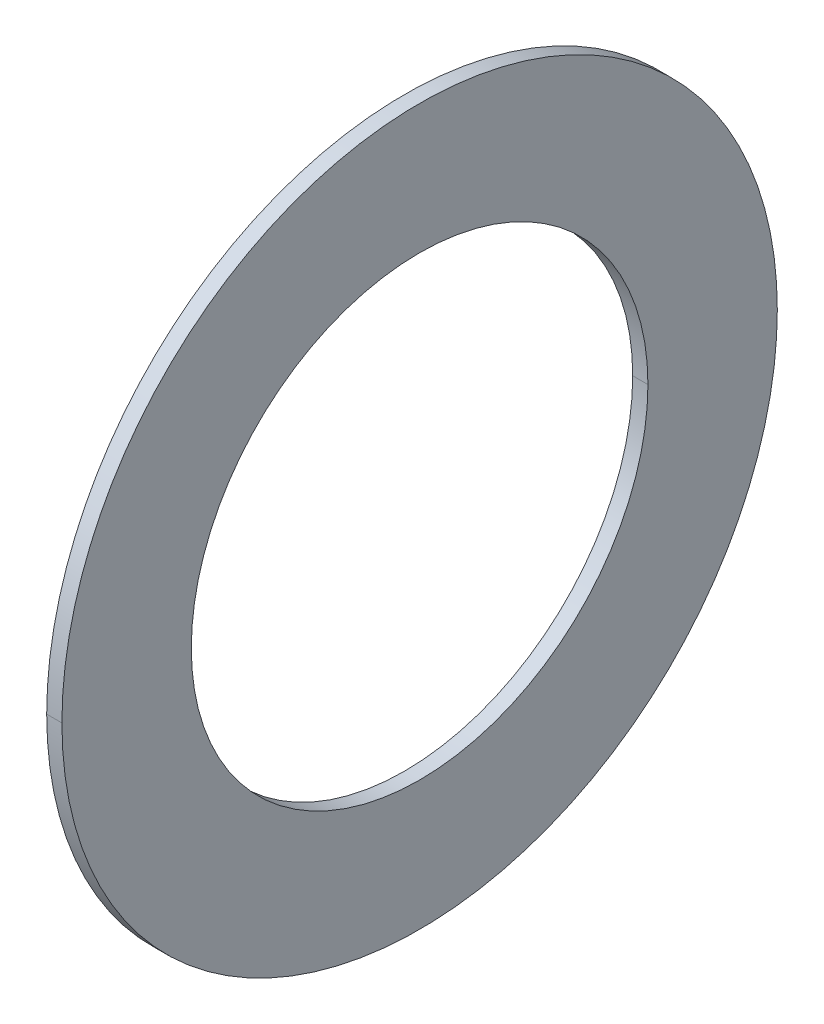
ISO-10303-21;
HEADER;
FILE_DESCRIPTION(('STEP AP214'),'2;1');
FILE_NAME('part.step','',(''),(''),'','','');
FILE_SCHEMA(('AUTOMOTIVE_DESIGN { 1 0 10303 214 1 1 1 1 }'));
ENDSEC;
DATA;
#1=APPLICATION_CONTEXT('core data for automotive mechanical design processes');
#2=APPLICATION_PROTOCOL_DEFINITION('international standard','automotive_design',2000,#1);
#3=PRODUCT_CONTEXT('',#1,'mechanical');
#4=PRODUCT('Part','Part','',(#3));
#5=PRODUCT_RELATED_PRODUCT_CATEGORY('part','',(#4));
#6=PRODUCT_DEFINITION_FORMATION('','',#4);
#7=PRODUCT_DEFINITION_CONTEXT('part definition',#1,'design');
#8=PRODUCT_DEFINITION('design','',#6,#7);
#9=PRODUCT_DEFINITION_SHAPE('','',#8);
#10=(LENGTH_UNIT() NAMED_UNIT(*) SI_UNIT(.MILLI.,.METRE.));
#11=(NAMED_UNIT(*) PLANE_ANGLE_UNIT() SI_UNIT($,.RADIAN.));
#12=(NAMED_UNIT(*) SI_UNIT($,.STERADIAN.) SOLID_ANGLE_UNIT());
#13=UNCERTAINTY_MEASURE_WITH_UNIT(LENGTH_MEASURE(1.E-05),#10,'distance_accuracy_value','');
#14=(GEOMETRIC_REPRESENTATION_CONTEXT(3) GLOBAL_UNCERTAINTY_ASSIGNED_CONTEXT((#13)) GLOBAL_UNIT_ASSIGNED_CONTEXT((#10,
#11,#12)) REPRESENTATION_CONTEXT('',''));
#15=CARTESIAN_POINT('',(0.,0.,0.));
#16=DIRECTION('',(0.,0.,1.));
#17=DIRECTION('',(1.,0.,0.));
#18=AXIS2_PLACEMENT_3D('',#15,#16,#17);
#19=CARTESIAN_POINT('',(-2.,23.5,0.));
#20=DIRECTION('',(-1.,0.,0.));
#21=DIRECTION('',(0.,0.,1.));
#22=AXIS2_PLACEMENT_3D('',#19,#20,#21);
#23=PLANE('',#22);
#24=CARTESIAN_POINT('',(-2.,0.,0.));
#25=DIRECTION('',(1.,0.,0.));
#26=DIRECTION('',(0.,0.,-1.));
#27=AXIS2_PLACEMENT_3D('',#24,#25,#26);
#28=CIRCLE('',#27,15.);
#29=CARTESIAN_POINT('',(-2.,0.,-15.));
#30=VERTEX_POINT('',#29);
#31=CARTESIAN_POINT('',(-2.,0.,15.));
#32=VERTEX_POINT('',#31);
#33=EDGE_CURVE('E11',#30,#32,#28,.T.);
#34=ORIENTED_EDGE('',*,*,#33,.T.);
#35=CARTESIAN_POINT('',(-2.,0.,0.));
#36=DIRECTION('',(1.,0.,0.));
#37=DIRECTION('',(0.,0.,-1.));
#38=AXIS2_PLACEMENT_3D('',#35,#36,#37);
#39=CIRCLE('',#38,15.);
#40=EDGE_CURVE('E25',#32,#30,#39,.T.);
#41=ORIENTED_EDGE('',*,*,#40,.T.);
#42=EDGE_LOOP('',(#34,#41));
#43=FACE_BOUND('',#42,.T.);
#44=CARTESIAN_POINT('',(-2.,0.,0.));
#45=DIRECTION('',(1.,0.,0.));
#46=DIRECTION('',(0.,0.,-1.));
#47=AXIS2_PLACEMENT_3D('',#44,#45,#46);
#48=CIRCLE('',#47,23.5);
#49=CARTESIAN_POINT('',(-2.,0.,23.5));
#50=VERTEX_POINT('',#49);
#51=CARTESIAN_POINT('',(-2.,0.,-23.5));
#52=VERTEX_POINT('',#51);
#53=EDGE_CURVE('E95',#50,#52,#48,.T.);
#54=ORIENTED_EDGE('',*,*,#53,.F.);
#55=CARTESIAN_POINT('',(-2.,0.,0.));
#56=DIRECTION('',(1.,0.,0.));
#57=DIRECTION('',(0.,0.,-1.));
#58=AXIS2_PLACEMENT_3D('',#55,#56,#57);
#59=CIRCLE('',#58,23.5);
#60=EDGE_CURVE('E90',#52,#50,#59,.T.);
#61=ORIENTED_EDGE('',*,*,#60,.F.);
#62=EDGE_LOOP('',(#54,#61));
#63=FACE_BOUND('',#62,.T.);
#64=ADVANCED_FACE('F17',(#43,#63),#23,.T.);
#65=CARTESIAN_POINT('',(50.,0.,0.));
#66=DIRECTION('',(1.,0.,0.));
#67=DIRECTION('',(0.,-1.,0.));
#68=AXIS2_PLACEMENT_3D('',#65,#66,#67);
#69=CYLINDRICAL_SURFACE('',#68,23.5);
#70=DIRECTION('',(1.,0.,0.));
#71=VECTOR('',#70,1.);
#72=CARTESIAN_POINT('',(-2.,0.,23.5));
#73=LINE('',#72,#71);
#74=CARTESIAN_POINT('',(-1.,0.,23.5));
#75=VERTEX_POINT('',#74);
#76=EDGE_CURVE('E86',#50,#75,#73,.T.);
#77=ORIENTED_EDGE('',*,*,#76,.T.);
#78=CARTESIAN_POINT('',(-1.,0.,0.));
#79=DIRECTION('',(1.,0.,0.));
#80=DIRECTION('',(0.,0.,-1.));
#81=AXIS2_PLACEMENT_3D('',#78,#79,#80);
#82=CIRCLE('',#81,23.5);
#83=CARTESIAN_POINT('',(-1.,0.,-23.5));
#84=VERTEX_POINT('',#83);
#85=EDGE_CURVE('E81',#84,#75,#82,.T.);
#86=ORIENTED_EDGE('',*,*,#85,.F.);
#87=DIRECTION('',(1.,0.,0.));
#88=VECTOR('',#87,1.);
#89=CARTESIAN_POINT('',(-2.,0.,-23.5));
#90=LINE('',#89,#88);
#91=EDGE_CURVE('E70',#52,#84,#90,.T.);
#92=ORIENTED_EDGE('',*,*,#91,.F.);
#93=ORIENTED_EDGE('',*,*,#60,.T.);
#94=EDGE_LOOP('',(#77,#86,#92,#93));
#95=FACE_BOUND('',#94,.T.);
#96=ADVANCED_FACE('F111',(#95),#69,.T.);
#97=CARTESIAN_POINT('',(50.,0.,0.));
#98=DIRECTION('',(1.,0.,0.));
#99=DIRECTION('',(0.,1.,0.));
#100=AXIS2_PLACEMENT_3D('',#97,#98,#99);
#101=CYLINDRICAL_SURFACE('',#100,23.5);
#102=ORIENTED_EDGE('',*,*,#76,.F.);
#103=ORIENTED_EDGE('',*,*,#53,.T.);
#104=ORIENTED_EDGE('',*,*,#91,.T.);
#105=CARTESIAN_POINT('',(-1.,0.,0.));
#106=DIRECTION('',(1.,0.,0.));
#107=DIRECTION('',(0.,0.,-1.));
#108=AXIS2_PLACEMENT_3D('',#105,#106,#107);
#109=CIRCLE('',#108,23.5);
#110=EDGE_CURVE('E67',#75,#84,#109,.T.);
#111=ORIENTED_EDGE('',*,*,#110,.F.);
#112=EDGE_LOOP('',(#102,#103,#104,#111));
#113=FACE_BOUND('',#112,.T.);
#114=ADVANCED_FACE('F106',(#113),#101,.T.);
#115=CARTESIAN_POINT('',(-1.,15.,0.));
#116=DIRECTION('',(1.,0.,0.));
#117=DIRECTION('',(0.,0.,-1.));
#118=AXIS2_PLACEMENT_3D('',#115,#116,#117);
#119=PLANE('',#118);
#120=ORIENTED_EDGE('',*,*,#85,.T.);
#121=ORIENTED_EDGE('',*,*,#110,.T.);
#122=EDGE_LOOP('',(#120,#121));
#123=FACE_BOUND('',#122,.T.);
#124=CARTESIAN_POINT('',(-1.,0.,0.));
#125=DIRECTION('',(1.,0.,0.));
#126=DIRECTION('',(0.,0.,-1.));
#127=AXIS2_PLACEMENT_3D('',#124,#125,#126);
#128=CIRCLE('',#127,15.);
#129=CARTESIAN_POINT('',(-1.,0.,15.));
#130=VERTEX_POINT('',#129);
#131=CARTESIAN_POINT('',(-1.,0.,-15.));
#132=VERTEX_POINT('',#131);
#133=EDGE_CURVE('E55',#130,#132,#128,.T.);
#134=ORIENTED_EDGE('',*,*,#133,.F.);
#135=CARTESIAN_POINT('',(-1.,0.,0.));
#136=DIRECTION('',(1.,0.,0.));
#137=DIRECTION('',(0.,0.,-1.));
#138=AXIS2_PLACEMENT_3D('',#135,#136,#137);
#139=CIRCLE('',#138,15.);
#140=EDGE_CURVE('E51',#132,#130,#139,.T.);
#141=ORIENTED_EDGE('',*,*,#140,.F.);
#142=EDGE_LOOP('',(#134,#141));
#143=FACE_BOUND('',#142,.T.);
#144=ADVANCED_FACE('F53',(#123,#143),#119,.T.);
#145=CARTESIAN_POINT('',(50.,0.,0.));
#146=DIRECTION('',(1.,0.,0.));
#147=DIRECTION('',(0.,-1.,0.));
#148=AXIS2_PLACEMENT_3D('',#145,#146,#147);
#149=CYLINDRICAL_SURFACE('',#148,15.);
#150=DIRECTION('',(1.,0.,0.));
#151=VECTOR('',#150,1.);
#152=CARTESIAN_POINT('',(-2.,0.,15.));
#153=LINE('',#152,#151);
#154=EDGE_CURVE('E59',#32,#130,#153,.T.);
#155=ORIENTED_EDGE('',*,*,#154,.F.);
#156=ORIENTED_EDGE('',*,*,#33,.F.);
#157=DIRECTION('',(1.,0.,0.));
#158=VECTOR('',#157,1.);
#159=CARTESIAN_POINT('',(-2.,0.,-15.));
#160=LINE('',#159,#158);
#161=EDGE_CURVE('E62',#30,#132,#160,.T.);
#162=ORIENTED_EDGE('',*,*,#161,.T.);
#163=ORIENTED_EDGE('',*,*,#140,.T.);
#164=EDGE_LOOP('',(#155,#156,#162,#163));
#165=FACE_BOUND('',#164,.T.);
#166=ADVANCED_FACE('F63',(#165),#149,.F.);
#167=CARTESIAN_POINT('',(50.,0.,0.));
#168=DIRECTION('',(1.,0.,0.));
#169=DIRECTION('',(0.,1.,0.));
#170=AXIS2_PLACEMENT_3D('',#167,#168,#169);
#171=CYLINDRICAL_SURFACE('',#170,15.);
#172=ORIENTED_EDGE('',*,*,#154,.T.);
#173=ORIENTED_EDGE('',*,*,#133,.T.);
#174=ORIENTED_EDGE('',*,*,#161,.F.);
#175=ORIENTED_EDGE('',*,*,#40,.F.);
#176=EDGE_LOOP('',(#172,#173,#174,#175));
#177=FACE_BOUND('',#176,.T.);
#178=ADVANCED_FACE('F66',(#177),#171,.F.);
#179=CLOSED_SHELL('',(#64,#96,#114,#144,#166,#178));
#180=MANIFOLD_SOLID_BREP('B1',#179);
#181=ADVANCED_BREP_SHAPE_REPRESENTATION('',(#18,#180),#14);
#182=SHAPE_DEFINITION_REPRESENTATION(#9,#181);
ENDSEC;
END-ISO-10303-21;
